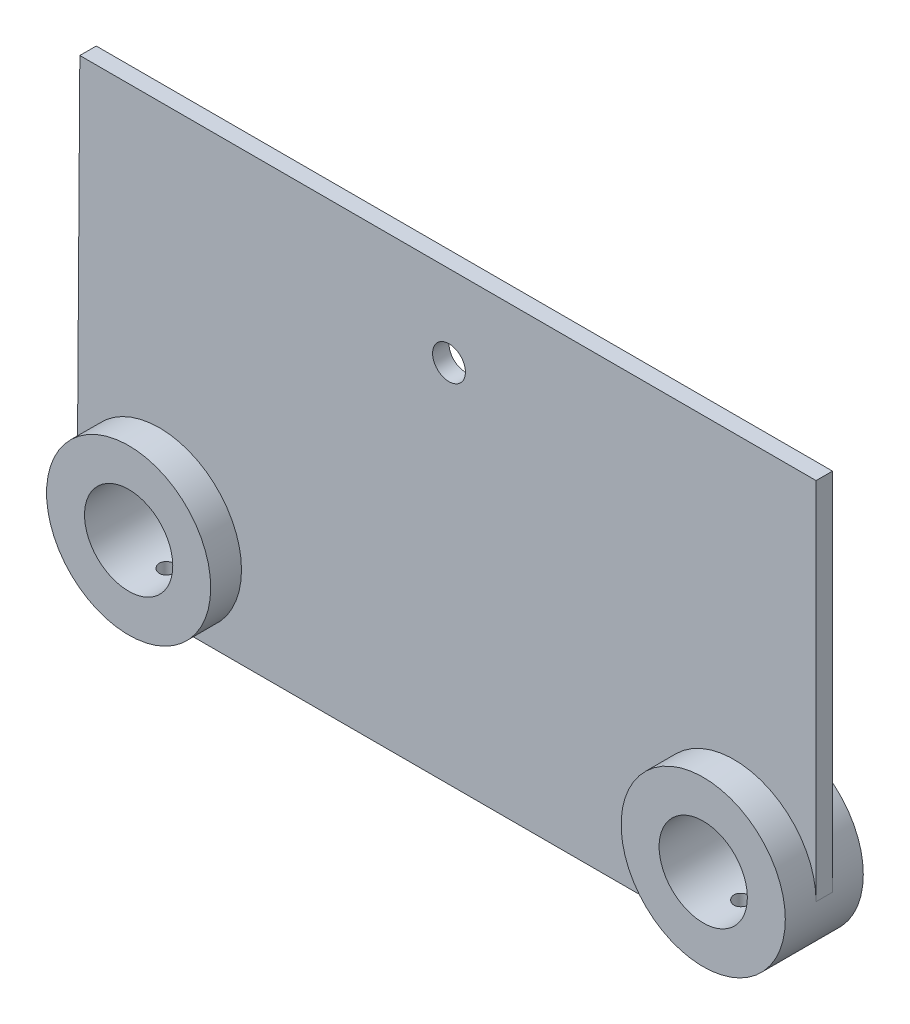
ISO-10303-21;
HEADER;
FILE_DESCRIPTION(('STEP AP214'),'2;1');
FILE_NAME('part.step','',(''),(''),'','','');
FILE_SCHEMA(('AUTOMOTIVE_DESIGN { 1 0 10303 214 1 1 1 1 }'));
ENDSEC;
DATA;
#1=APPLICATION_CONTEXT('core data for automotive mechanical design processes');
#2=APPLICATION_PROTOCOL_DEFINITION('international standard','automotive_design',2000,#1);
#3=PRODUCT_CONTEXT('',#1,'mechanical');
#4=PRODUCT('Part','Part','',(#3));
#5=PRODUCT_RELATED_PRODUCT_CATEGORY('part','',(#4));
#6=PRODUCT_DEFINITION_FORMATION('','',#4);
#7=PRODUCT_DEFINITION_CONTEXT('part definition',#1,'design');
#8=PRODUCT_DEFINITION('design','',#6,#7);
#9=PRODUCT_DEFINITION_SHAPE('','',#8);
#10=(LENGTH_UNIT() NAMED_UNIT(*) SI_UNIT(.MILLI.,.METRE.));
#11=(NAMED_UNIT(*) PLANE_ANGLE_UNIT() SI_UNIT($,.RADIAN.));
#12=(NAMED_UNIT(*) SI_UNIT($,.STERADIAN.) SOLID_ANGLE_UNIT());
#13=UNCERTAINTY_MEASURE_WITH_UNIT(LENGTH_MEASURE(1.E-05),#10,'distance_accuracy_value','');
#14=(GEOMETRIC_REPRESENTATION_CONTEXT(3) GLOBAL_UNCERTAINTY_ASSIGNED_CONTEXT((#13)) GLOBAL_UNIT_ASSIGNED_CONTEXT((#10,
#11,#12)) REPRESENTATION_CONTEXT('',''));
#15=CARTESIAN_POINT('',(0.,0.,0.));
#16=DIRECTION('',(0.,0.,1.));
#17=DIRECTION('',(1.,0.,0.));
#18=AXIS2_PLACEMENT_3D('',#15,#16,#17);
#19=CARTESIAN_POINT('',(70.,0.,2.));
#20=DIRECTION('',(0.,0.,1.));
#21=DIRECTION('',(1.,0.,0.));
#22=AXIS2_PLACEMENT_3D('',#19,#20,#21);
#23=PLANE('',#22);
#24=CARTESIAN_POINT('',(0.554740673181675,69.,2.));
#25=DIRECTION('',(0.,0.,1.));
#26=DIRECTION('',(1.,0.,0.));
#27=AXIS2_PLACEMENT_3D('',#24,#25,#26);
#28=CIRCLE('',#27,4.);
#29=CARTESIAN_POINT('',(4.55474067318168,69.,2.));
#30=VERTEX_POINT('',#29);
#31=EDGE_CURVE('E140',#30,#30,#28,.T.);
#32=ORIENTED_EDGE('',*,*,#31,.F.);
#33=EDGE_LOOP('',(#32));
#34=FACE_BOUND('',#33,.T.);
#35=DIRECTION('',(1.,0.,0.));
#36=VECTOR('',#35,1.);
#37=CARTESIAN_POINT('',(-70.,-20.,2.));
#38=LINE('',#37,#36);
#39=CARTESIAN_POINT('',(-70.,-20.,2.));
#40=VERTEX_POINT('',#39);
#41=CARTESIAN_POINT('',(70.,-20.,2.));
#42=VERTEX_POINT('',#41);
#43=EDGE_CURVE('E114',#40,#42,#38,.T.);
#44=ORIENTED_EDGE('',*,*,#43,.T.);
#45=CARTESIAN_POINT('',(70.,0.,2.));
#46=DIRECTION('',(0.,0.,1.));
#47=DIRECTION('',(1.,0.,0.));
#48=AXIS2_PLACEMENT_3D('',#45,#46,#47);
#49=CIRCLE('',#48,20.);
#50=CARTESIAN_POINT('',(90.,0.,2.));
#51=VERTEX_POINT('',#50);
#52=EDGE_CURVE('E120',#42,#51,#49,.F.);
#53=ORIENTED_EDGE('',*,*,#52,.T.);
#54=DIRECTION('',(0.,1.,0.));
#55=VECTOR('',#54,1.);
#56=CARTESIAN_POINT('',(90.,88.85,2.));
#57=LINE('',#56,#55);
#58=CARTESIAN_POINT('',(90.,88.85,2.));
#59=VERTEX_POINT('',#58);
#60=EDGE_CURVE('E64',#51,#59,#57,.T.);
#61=ORIENTED_EDGE('',*,*,#60,.T.);
#62=DIRECTION('',(-1.,0.,0.));
#63=VECTOR('',#62,1.);
#64=CARTESIAN_POINT('',(-89.3894864788953,88.85,2.));
#65=LINE('',#64,#63);
#66=CARTESIAN_POINT('',(-89.3894864788953,88.85,2.));
#67=VERTEX_POINT('',#66);
#68=EDGE_CURVE('E132',#59,#67,#65,.T.);
#69=ORIENTED_EDGE('',*,*,#68,.T.);
#70=DIRECTION('',(-0.00687112109239564,-0.999976393568835,0.));
#71=VECTOR('',#70,1.);
#72=CARTESIAN_POINT('',(-89.3894864788953,88.85,2.));
#73=LINE('',#72,#71);
#74=CARTESIAN_POINT('',(-89.9981115077974,0.274838355588614,2.));
#75=VERTEX_POINT('',#74);
#76=EDGE_CURVE('E86',#67,#75,#73,.T.);
#77=ORIENTED_EDGE('',*,*,#76,.T.);
#78=CARTESIAN_POINT('',(-70.,0.,2.));
#79=DIRECTION('',(0.,0.,1.));
#80=DIRECTION('',(1.,0.,0.));
#81=AXIS2_PLACEMENT_3D('',#78,#79,#80);
#82=CIRCLE('',#81,20.);
#83=EDGE_CURVE('E128',#75,#40,#82,.F.);
#84=ORIENTED_EDGE('',*,*,#83,.T.);
#85=EDGE_LOOP('',(#44,#53,#61,#69,#77,#84));
#86=FACE_BOUND('',#85,.T.);
#87=ADVANCED_FACE('F33',(#34,#86),#23,.T.);
#88=CARTESIAN_POINT('',(70.,0.,-2.));
#89=DIRECTION('',(0.,0.,1.));
#90=DIRECTION('',(1.,0.,0.));
#91=AXIS2_PLACEMENT_3D('',#88,#89,#90);
#92=PLANE('',#91);
#93=CARTESIAN_POINT('',(0.554740673181675,69.,-2.));
#94=DIRECTION('',(0.,0.,1.));
#95=DIRECTION('',(1.,0.,0.));
#96=AXIS2_PLACEMENT_3D('',#93,#94,#95);
#97=CIRCLE('',#96,4.);
#98=CARTESIAN_POINT('',(4.55474067318168,69.,-2.));
#99=VERTEX_POINT('',#98);
#100=EDGE_CURVE('E202',#99,#99,#97,.F.);
#101=ORIENTED_EDGE('',*,*,#100,.F.);
#102=EDGE_LOOP('',(#101));
#103=FACE_BOUND('',#102,.T.);
#104=CARTESIAN_POINT('',(70.,0.,-2.));
#105=DIRECTION('',(0.,0.,1.));
#106=DIRECTION('',(1.,0.,0.));
#107=AXIS2_PLACEMENT_3D('',#104,#105,#106);
#108=CIRCLE('',#107,20.);
#109=CARTESIAN_POINT('',(70.,-20.,-2.));
#110=VERTEX_POINT('',#109);
#111=CARTESIAN_POINT('',(90.,0.,-2.));
#112=VERTEX_POINT('',#111);
#113=EDGE_CURVE('E124',#110,#112,#108,.F.);
#114=ORIENTED_EDGE('',*,*,#113,.F.);
#115=DIRECTION('',(1.,0.,0.));
#116=VECTOR('',#115,1.);
#117=CARTESIAN_POINT('',(-70.,-20.,-2.));
#118=LINE('',#117,#116);
#119=CARTESIAN_POINT('',(-70.,-20.,-2.));
#120=VERTEX_POINT('',#119);
#121=EDGE_CURVE('E116',#120,#110,#118,.T.);
#122=ORIENTED_EDGE('',*,*,#121,.F.);
#123=CARTESIAN_POINT('',(-70.,0.,-2.));
#124=DIRECTION('',(0.,0.,1.));
#125=DIRECTION('',(1.,0.,0.));
#126=AXIS2_PLACEMENT_3D('',#123,#124,#125);
#127=CIRCLE('',#126,20.);
#128=CARTESIAN_POINT('',(-89.9981115077974,0.274838355589222,-2.));
#129=VERTEX_POINT('',#128);
#130=EDGE_CURVE('E213',#129,#120,#127,.F.);
#131=ORIENTED_EDGE('',*,*,#130,.F.);
#132=DIRECTION('',(-0.00687112109239564,-0.999976393568835,0.));
#133=VECTOR('',#132,1.);
#134=CARTESIAN_POINT('',(-89.3894864788953,88.85,-2.));
#135=LINE('',#134,#133);
#136=CARTESIAN_POINT('',(-89.3894864788953,88.85,-2.));
#137=VERTEX_POINT('',#136);
#138=EDGE_CURVE('E139',#137,#129,#135,.T.);
#139=ORIENTED_EDGE('',*,*,#138,.F.);
#140=DIRECTION('',(-1.,0.,0.));
#141=VECTOR('',#140,1.);
#142=CARTESIAN_POINT('',(-89.3894864788953,88.85,-2.));
#143=LINE('',#142,#141);
#144=CARTESIAN_POINT('',(90.,88.85,-2.));
#145=VERTEX_POINT('',#144);
#146=EDGE_CURVE('E136',#145,#137,#143,.T.);
#147=ORIENTED_EDGE('',*,*,#146,.F.);
#148=DIRECTION('',(0.,1.,0.));
#149=VECTOR('',#148,1.);
#150=CARTESIAN_POINT('',(90.,88.85,-2.));
#151=LINE('',#150,#149);
#152=EDGE_CURVE('E84',#112,#145,#151,.T.);
#153=ORIENTED_EDGE('',*,*,#152,.F.);
#154=EDGE_LOOP('',(#114,#122,#131,#139,#147,#153));
#155=FACE_BOUND('',#154,.T.);
#156=ADVANCED_FACE('F188',(#103,#155),#92,.F.);
#157=CARTESIAN_POINT('',(-89.3894864788953,88.85,2.));
#158=DIRECTION('',(0.999976393568835,-0.00687112109239564,0.));
#159=DIRECTION('',(0.00687112109239564,0.999976393568835,0.));
#160=AXIS2_PLACEMENT_3D('',#157,#158,#159);
#161=PLANE('',#160);
#162=DIRECTION('',(0.,0.,-1.));
#163=VECTOR('',#162,1.);
#164=CARTESIAN_POINT('',(-89.9981115077974,0.274838355588631,9.5));
#165=LINE('',#164,#163);
#166=EDGE_CURVE('E55',#75,#129,#165,.T.);
#167=ORIENTED_EDGE('',*,*,#166,.F.);
#168=ORIENTED_EDGE('',*,*,#76,.F.);
#169=DIRECTION('',(0.,0.,-1.));
#170=VECTOR('',#169,1.);
#171=CARTESIAN_POINT('',(-89.3894864788953,88.85,2.));
#172=LINE('',#171,#170);
#173=EDGE_CURVE('E11',#67,#137,#172,.T.);
#174=ORIENTED_EDGE('',*,*,#173,.T.);
#175=ORIENTED_EDGE('',*,*,#138,.T.);
#176=EDGE_LOOP('',(#167,#168,#174,#175));
#177=FACE_BOUND('',#176,.T.);
#178=ADVANCED_FACE('F186',(#177),#161,.F.);
#179=CARTESIAN_POINT('',(-89.3894864788953,88.85,2.));
#180=DIRECTION('',(0.,-1.,0.));
#181=DIRECTION('',(0.,0.,-1.));
#182=AXIS2_PLACEMENT_3D('',#179,#180,#181);
#183=PLANE('',#182);
#184=ORIENTED_EDGE('',*,*,#146,.T.);
#185=ORIENTED_EDGE('',*,*,#173,.F.);
#186=ORIENTED_EDGE('',*,*,#68,.F.);
#187=DIRECTION('',(0.,0.,-1.));
#188=VECTOR('',#187,1.);
#189=CARTESIAN_POINT('',(90.,88.85,2.));
#190=LINE('',#189,#188);
#191=EDGE_CURVE('E130',#59,#145,#190,.T.);
#192=ORIENTED_EDGE('',*,*,#191,.T.);
#193=EDGE_LOOP('',(#184,#185,#186,#192));
#194=FACE_BOUND('',#193,.T.);
#195=ADVANCED_FACE('F35',(#194),#183,.F.);
#196=CARTESIAN_POINT('',(-70.,0.,2.));
#197=DIRECTION('',(0.,0.,-1.));
#198=DIRECTION('',(-1.,0.,0.));
#199=AXIS2_PLACEMENT_3D('',#196,#197,#198);
#200=CYLINDRICAL_SURFACE('',#199,20.);
#201=ORIENTED_EDGE('',*,*,#130,.T.);
#202=CARTESIAN_POINT('',(-70.,-20.,2.));
#203=CARTESIAN_POINT('',(-69.8879592924169,-19.9999987104154,1.99999514819924));
#204=CARTESIAN_POINT('',(-69.7758445096645,-19.9990485119241,1.99055346220711));
#205=CARTESIAN_POINT('',(-69.5547232030063,-19.9953493518948,1.95303125941914));
#206=CARTESIAN_POINT('',(-69.4457202416624,-19.9925984086805,1.92493020795082));
#207=CARTESIAN_POINT('',(-69.2340566490932,-19.9856082912614,1.85091551880433));
#208=CARTESIAN_POINT('',(-69.1313922307702,-19.9813700160142,1.80501263896305));
#209=CARTESIAN_POINT('',(-68.9352476780792,-19.9718791478861,1.69671818413671));
#210=CARTESIAN_POINT('',(-68.8417657224418,-19.9666267567626,1.63432988799972));
#211=CARTESIAN_POINT('',(-68.6662808986519,-19.9556748868265,1.49459460467545));
#212=CARTESIAN_POINT('',(-68.5843157103302,-19.9499740314773,1.41720040119593));
#213=CARTESIAN_POINT('',(-68.434514957138,-19.9387791381253,1.24975093147394));
#214=CARTESIAN_POINT('',(-68.3666800458347,-19.9332851096983,1.15969507991523));
#215=CARTESIAN_POINT('',(-68.2469320591128,-19.9231118310557,0.969242936632761));
#216=CARTESIAN_POINT('',(-68.1950530690902,-19.9184343342181,0.868825111810284));
#217=CARTESIAN_POINT('',(-68.1089072305145,-19.9104407509305,0.660648828190043));
#218=CARTESIAN_POINT('',(-68.0746399468174,-19.9071246308444,0.552890550832102));
#219=CARTESIAN_POINT('',(-68.0248019167962,-19.9022416814596,0.333476398267984));
#220=CARTESIAN_POINT('',(-68.0091686939924,-19.9006690079619,0.221834846295587));
#221=CARTESIAN_POINT('',(-67.9968494297293,-19.8994328612105,-0.00249772679155691));
#222=CARTESIAN_POINT('',(-68.0001628902584,-19.8997693377749,-0.115188720244114));
#223=CARTESIAN_POINT('',(-68.0255914394946,-19.9023081379787,-0.337990619386631));
#224=CARTESIAN_POINT('',(-68.0476383117509,-19.904503691813,-0.448109398657382));
#225=CARTESIAN_POINT('',(-68.1098017116988,-19.9105026857484,-0.663075926402181));
#226=CARTESIAN_POINT('',(-68.1499184834885,-19.9143061475698,-0.767923603650055));
#227=CARTESIAN_POINT('',(-68.247158212237,-19.9231001890414,-0.969587174597771));
#228=CARTESIAN_POINT('',(-68.30431143456,-19.9280928781632,-1.06638837897862));
#229=CARTESIAN_POINT('',(-68.4339799452935,-19.9387010346576,-1.24905042982376));
#230=CARTESIAN_POINT('',(-68.506495683327,-19.9443165202557,-1.33491095596352));
#231=CARTESIAN_POINT('',(-68.6652117751759,-19.9555677062598,-1.49365078797805));
#232=CARTESIAN_POINT('',(-68.7514710422973,-19.96120338666,-1.5664712037616));
#233=CARTESIAN_POINT('',(-68.9350210365258,-19.9718365815704,-1.69660726582077));
#234=CARTESIAN_POINT('',(-69.0323117760008,-19.9768340953651,-1.75392289471295));
#235=CARTESIAN_POINT('',(-69.2352037886153,-19.9856295133419,-1.8514200406205));
#236=CARTESIAN_POINT('',(-69.3408065072202,-19.9894272082954,-1.89159856963612));
#237=CARTESIAN_POINT('',(-69.5573055653401,-19.9953929488282,-1.9536378334235));
#238=CARTESIAN_POINT('',(-69.6682017464468,-19.9975610431413,-1.97549911598124));
#239=CARTESIAN_POINT('',(-69.8916298018162,-20.0000170333662,-2.00020861546953));
#240=CARTESIAN_POINT('',(-70.004152604211,-20.0003129653547,-2.00313809650499));
#241=CARTESIAN_POINT('',(-70.2280875866314,-19.9990128351359,-1.99011427390247));
#242=CARTESIAN_POINT('',(-70.3394997816409,-19.9974167984894,-1.97416122536944));
#243=CARTESIAN_POINT('',(-70.5578164136693,-19.9925172307839,-1.92389260915685));
#244=CARTESIAN_POINT('',(-70.664729697944,-19.9892172383608,-1.88961509104398));
#245=CARTESIAN_POINT('',(-70.8712886427676,-19.9812799772122,-1.80370965192546));
#246=CARTESIAN_POINT('',(-70.9709341403142,-19.9766426785051,-1.75208134192121));
#247=CARTESIAN_POINT('',(-71.1604963603443,-19.9665295066084,-1.63273832267218));
#248=CARTESIAN_POINT('',(-71.2503793194978,-19.9610508720688,-1.56497022214837));
#249=CARTESIAN_POINT('',(-71.4175232466237,-19.9498786573904,-1.41534786451815));
#250=CARTESIAN_POINT('',(-71.4947838976984,-19.9441850718594,-1.33349325385936));
#251=CARTESIAN_POINT('',(-71.6347722197743,-19.9332004828151,-1.15766685068199));
#252=CARTESIAN_POINT('',(-71.6974465573591,-19.9279110027795,-1.06365248691475));
#253=CARTESIAN_POINT('',(-71.8061165174877,-19.9183566492178,-0.866385279706636));
#254=CARTESIAN_POINT('',(-71.8521123681078,-19.9140917616808,-0.763132562623218));
#255=CARTESIAN_POINT('',(-71.9260304173689,-19.907078952681,-0.550502521068425));
#256=CARTESIAN_POINT('',(-71.9539843496237,-19.9043283689958,-0.44113631981777));
#257=CARTESIAN_POINT('',(-71.9911280142589,-19.9006473056575,-0.219233604078463));
#258=CARTESIAN_POINT('',(-72.000318284799,-19.8997167738037,-0.106697180608657));
#259=CARTESIAN_POINT('',(-71.9996662769425,-19.8997822621512,0.117821376713405));
#260=CARTESIAN_POINT('',(-71.9899077791862,-19.9007698017402,0.229803765765626));
#261=CARTESIAN_POINT('',(-71.9518109059273,-19.9045420777909,0.45052983433657));
#262=CARTESIAN_POINT('',(-71.9234725095243,-19.9073268162744,0.559273510211952));
#263=CARTESIAN_POINT('',(-71.849043372595,-19.9143773652637,0.770434698095707));
#264=CARTESIAN_POINT('',(-71.8029550886818,-19.9186429708072,0.872853083259445));
#265=CARTESIAN_POINT('',(-71.6943431098221,-19.9281750367872,1.06851378334207));
#266=CARTESIAN_POINT('',(-71.6318195069108,-19.933441491619,1.16175614964125));
#267=CARTESIAN_POINT('',(-71.4917971125707,-19.944409744194,1.33684734894386));
#268=CARTESIAN_POINT('',(-71.4142358977806,-19.950113294535,1.41864615273416));
#269=CARTESIAN_POINT('',(-71.2464633984502,-19.9612970945757,1.5681044653993));
#270=CARTESIAN_POINT('',(-71.1562490882165,-19.9667772904595,1.63576058271433));
#271=CARTESIAN_POINT('',(-70.9654828683226,-19.9769112413832,1.75514690770924));
#272=CARTESIAN_POINT('',(-70.8649054986935,-19.9815628805362,1.80683658189036));
#273=CARTESIAN_POINT('',(-70.6565165582011,-19.9894925849979,1.89252484564773));
#274=CARTESIAN_POINT('',(-70.5487132996512,-19.9927721981931,1.92654338190709));
#275=CARTESIAN_POINT('',(-70.3669165228114,-19.9967642754747,1.9674412341696));
#276=CARTESIAN_POINT('',(-70.294085105689,-19.9979720138367,1.97963408859871));
#277=CARTESIAN_POINT('',(-70.1475131616346,-19.9995902990157,1.99591505212352));
#278=CARTESIAN_POINT('',(-70.0737726384531,-20.0000008491205,2.00000319464372));
#279=CARTESIAN_POINT('',(-70.,-20.,2.));
#280=B_SPLINE_CURVE_WITH_KNOTS('',3,(#202,#203,#204,#205,#206,#207,#208,#209,#210,#211,#212,
#213,#214,#215,#216,#217,#218,#219,#220,#221,#222,#223,#224,#225,#226,#227,#228,#229,#230,#231,
#232,#233,#234,#235,#236,#237,#238,#239,#240,#241,#242,#243,#244,#245,#246,#247,#248,#249,#250,
#251,#252,#253,#254,#255,#256,#257,#258,#259,#260,#261,#262,#263,#264,#265,#266,#267,#268,#269,
#270,#271,#272,#273,#274,#275,#276,#277,#278,#279),.UNSPECIFIED.,.T.,.F.,(4,2,2,2,2,2,2,2,2,2,2,
2,2,2,2,2,2,2,2,2,2,2,2,2,2,2,2,2,2,2,2,2,2,2,2,2,2,2,4),(0.,0.335852732536946,
0.672075685670967,1.0080957714644,1.34404907516556,1.68107713724588,2.0181207844141,
2.35587950944443,2.69362988885007,3.03024464090392,3.36685054511552,3.70223594882219,
4.03762588323266,4.37361522745788,4.70961440662249,5.04709468392412,5.38457533959542,
5.72211481387162,6.05964419350877,6.39572377215513,6.73179881038284,7.06717870588607,
7.4025661209893,7.73907881497394,8.07559995620459,8.41333287217195,8.75106116950745,
9.08819381186003,9.42531678479168,9.7609525858791,10.0965887645208,10.432178507256,
10.7677663707792,11.104778348553,11.4418710527391,11.7798126205248,12.1173718959059,
12.3385133446469,12.5596538813805),.UNSPECIFIED.);
#281=EDGE_CURVE('E169',#120,#40,#280,.T.);
#282=ORIENTED_EDGE('',*,*,#281,.T.);
#283=ORIENTED_EDGE('',*,*,#83,.F.);
#284=ORIENTED_EDGE('',*,*,#166,.T.);
#285=EDGE_LOOP('',(#201,#282,#283,#284));
#286=FACE_BOUND('',#285,.T.);
#287=CARTESIAN_POINT('',(-70.,0.,9.5));
#288=DIRECTION('',(0.,0.,1.));
#289=DIRECTION('',(1.,0.,0.));
#290=AXIS2_PLACEMENT_3D('',#287,#288,#289);
#291=CIRCLE('',#290,20.);
#292=CARTESIAN_POINT('',(-50.,0.,9.5));
#293=VERTEX_POINT('',#292);
#294=EDGE_CURVE('E215',#293,#293,#291,.T.);
#295=ORIENTED_EDGE('',*,*,#294,.F.);
#296=EDGE_LOOP('',(#295));
#297=FACE_BOUND('',#296,.T.);
#298=CARTESIAN_POINT('',(-70.,0.,-9.5));
#299=DIRECTION('',(0.,0.,1.));
#300=DIRECTION('',(1.,0.,0.));
#301=AXIS2_PLACEMENT_3D('',#298,#299,#300);
#302=CIRCLE('',#301,20.);
#303=CARTESIAN_POINT('',(-50.,0.,-9.5));
#304=VERTEX_POINT('',#303);
#305=EDGE_CURVE('E220',#304,#304,#302,.T.);
#306=ORIENTED_EDGE('',*,*,#305,.T.);
#307=EDGE_LOOP('',(#306));
#308=FACE_BOUND('',#307,.T.);
#309=ADVANCED_FACE('F182',(#286,#297,#308),#200,.T.);
#310=CARTESIAN_POINT('',(-70.,-20.,2.));
#311=DIRECTION('',(0.,1.,0.));
#312=DIRECTION('',(0.,0.,1.));
#313=AXIS2_PLACEMENT_3D('',#310,#311,#312);
#314=PLANE('',#313);
#315=ORIENTED_EDGE('',*,*,#43,.F.);
#316=CARTESIAN_POINT('',(-70.,-20.,0.));
#317=DIRECTION('',(0.,1.,0.));
#318=DIRECTION('',(0.,0.,1.));
#319=AXIS2_PLACEMENT_3D('',#316,#317,#318);
#320=CIRCLE('',#319,2.);
#321=EDGE_CURVE('E117',#120,#40,#320,.F.);
#322=ORIENTED_EDGE('',*,*,#321,.F.);
#323=ORIENTED_EDGE('',*,*,#121,.T.);
#324=CARTESIAN_POINT('',(70.,-20.,0.));
#325=DIRECTION('',(0.,1.,0.));
#326=DIRECTION('',(0.,0.,1.));
#327=AXIS2_PLACEMENT_3D('',#324,#325,#326);
#328=CIRCLE('',#327,2.);
#329=EDGE_CURVE('E101',#42,#110,#328,.F.);
#330=ORIENTED_EDGE('',*,*,#329,.F.);
#331=EDGE_LOOP('',(#315,#322,#323,#330));
#332=FACE_BOUND('',#331,.T.);
#333=ADVANCED_FACE('F111',(#332),#314,.F.);
#334=CARTESIAN_POINT('',(70.,0.,2.));
#335=DIRECTION('',(0.,0.,-1.));
#336=DIRECTION('',(-1.,0.,0.));
#337=AXIS2_PLACEMENT_3D('',#334,#335,#336);
#338=CYLINDRICAL_SURFACE('',#337,20.);
#339=ORIENTED_EDGE('',*,*,#52,.F.);
#340=CARTESIAN_POINT('',(70.,-20.,2.));
#341=CARTESIAN_POINT('',(70.1120407075831,-19.9999987104154,1.99999514819924));
#342=CARTESIAN_POINT('',(70.2241554903355,-19.9990485119241,1.99055346220711));
#343=CARTESIAN_POINT('',(70.4452767969937,-19.9953493518948,1.95303125941914));
#344=CARTESIAN_POINT('',(70.5542797583377,-19.9925984086805,1.92493020795082));
#345=CARTESIAN_POINT('',(70.7659433509068,-19.9856082912614,1.85091551880433));
#346=CARTESIAN_POINT('',(70.8686077692298,-19.9813700160142,1.80501263896305));
#347=CARTESIAN_POINT('',(71.0647523219208,-19.9718791478861,1.69671818413671));
#348=CARTESIAN_POINT('',(71.1582342775582,-19.9666267567626,1.63432988799972));
#349=CARTESIAN_POINT('',(71.3337191013482,-19.9556748868265,1.49459460467545));
#350=CARTESIAN_POINT('',(71.4156842896698,-19.9499740314773,1.41720040119593));
#351=CARTESIAN_POINT('',(71.565485042862,-19.9387791381253,1.24975093147394));
#352=CARTESIAN_POINT('',(71.6333199541653,-19.9332851096983,1.15969507991523));
#353=CARTESIAN_POINT('',(71.7530679408872,-19.9231118310557,0.969242936632763));
#354=CARTESIAN_POINT('',(71.8049469309098,-19.9184343342181,0.868825111810288));
#355=CARTESIAN_POINT('',(71.8910927694855,-19.9104407509305,0.660648828190047));
#356=CARTESIAN_POINT('',(71.9253600531826,-19.9071246308444,0.552890550832104));
#357=CARTESIAN_POINT('',(71.9751980832038,-19.9022416814596,0.333476398267984));
#358=CARTESIAN_POINT('',(71.9908313060076,-19.9006690079619,0.221834846295587));
#359=CARTESIAN_POINT('',(72.0031505702707,-19.8994328612105,-0.00249772679155687));
#360=CARTESIAN_POINT('',(71.9998371097416,-19.8997693377749,-0.115188720244114));
#361=CARTESIAN_POINT('',(71.9744085605054,-19.9023081379787,-0.337990619386631));
#362=CARTESIAN_POINT('',(71.9523616882491,-19.904503691813,-0.448109398657382));
#363=CARTESIAN_POINT('',(71.8901982883012,-19.9105026857484,-0.663075926402181));
#364=CARTESIAN_POINT('',(71.8500815165115,-19.9143061475698,-0.767923603650055));
#365=CARTESIAN_POINT('',(71.752841787763,-19.9231001890414,-0.969587174597771));
#366=CARTESIAN_POINT('',(71.69568856544,-19.9280928781632,-1.06638837897862));
#367=CARTESIAN_POINT('',(71.5660200547065,-19.9387010346576,-1.24905042982376));
#368=CARTESIAN_POINT('',(71.493504316673,-19.9443165202557,-1.33491095596352));
#369=CARTESIAN_POINT('',(71.3347882248241,-19.9555677062598,-1.49365078797805));
#370=CARTESIAN_POINT('',(71.2485289577027,-19.96120338666,-1.5664712037616));
#371=CARTESIAN_POINT('',(71.0649789634742,-19.9718365815704,-1.69660726582077));
#372=CARTESIAN_POINT('',(70.9676882239992,-19.9768340953651,-1.75392289471295));
#373=CARTESIAN_POINT('',(70.7647962113847,-19.9856295133419,-1.8514200406205));
#374=CARTESIAN_POINT('',(70.6591934927798,-19.9894272082954,-1.89159856963612));
#375=CARTESIAN_POINT('',(70.4426944346599,-19.9953929488282,-1.9536378334235));
#376=CARTESIAN_POINT('',(70.3317982535532,-19.9975610431413,-1.97549911598124));
#377=CARTESIAN_POINT('',(70.1083701981838,-20.0000170333662,-2.00020861546953));
#378=CARTESIAN_POINT('',(69.995847395789,-20.0003129653547,-2.00313809650499));
#379=CARTESIAN_POINT('',(69.7719124133686,-19.9990128351359,-1.99011427390247));
#380=CARTESIAN_POINT('',(69.6605002183591,-19.9974167984894,-1.97416122536944));
#381=CARTESIAN_POINT('',(69.4421835863307,-19.9925172307839,-1.92389260915685));
#382=CARTESIAN_POINT('',(69.335270302056,-19.9892172383608,-1.88961509104398));
#383=CARTESIAN_POINT('',(69.1287113572325,-19.9812799772122,-1.80370965192546));
#384=CARTESIAN_POINT('',(69.0290658596858,-19.9766426785051,-1.75208134192121));
#385=CARTESIAN_POINT('',(68.8395036396557,-19.9665295066084,-1.63273832267218));
#386=CARTESIAN_POINT('',(68.7496206805022,-19.9610508720688,-1.56497022214837));
#387=CARTESIAN_POINT('',(68.5824767533763,-19.9498786573904,-1.41534786451815));
#388=CARTESIAN_POINT('',(68.5052161023017,-19.9441850718594,-1.33349325385936));
#389=CARTESIAN_POINT('',(68.3652277802257,-19.9332004828151,-1.15766685068199));
#390=CARTESIAN_POINT('',(68.3025534426409,-19.9279110027795,-1.06365248691476));
#391=CARTESIAN_POINT('',(68.1938834825124,-19.9183566492178,-0.86638527970664));
#392=CARTESIAN_POINT('',(68.1478876318922,-19.9140917616808,-0.76313256262322));
#393=CARTESIAN_POINT('',(68.0739695826311,-19.907078952681,-0.550502521068425));
#394=CARTESIAN_POINT('',(68.0460156503763,-19.9043283689958,-0.44113631981777));
#395=CARTESIAN_POINT('',(68.0088719857411,-19.9006473056575,-0.219233604078463));
#396=CARTESIAN_POINT('',(67.999681715201,-19.8997167738037,-0.106697180608657));
#397=CARTESIAN_POINT('',(68.0003337230575,-19.8997822621512,0.117821376713405));
#398=CARTESIAN_POINT('',(68.0100922208138,-19.9007698017402,0.229803765765626));
#399=CARTESIAN_POINT('',(68.0481890940727,-19.9045420777909,0.45052983433657));
#400=CARTESIAN_POINT('',(68.0765274904757,-19.9073268162744,0.559273510211952));
#401=CARTESIAN_POINT('',(68.150956627405,-19.9143773652637,0.770434698095707));
#402=CARTESIAN_POINT('',(68.1970449113182,-19.9186429708072,0.872853083259445));
#403=CARTESIAN_POINT('',(68.3056568901779,-19.9281750367872,1.06851378334207));
#404=CARTESIAN_POINT('',(68.3681804930892,-19.933441491619,1.16175614964125));
#405=CARTESIAN_POINT('',(68.5082028874293,-19.944409744194,1.33684734894386));
#406=CARTESIAN_POINT('',(68.5857641022195,-19.950113294535,1.41864615273417));
#407=CARTESIAN_POINT('',(68.7535366015498,-19.9612970945757,1.56810446539931));
#408=CARTESIAN_POINT('',(68.8437509117835,-19.9667772904595,1.63576058271433));
#409=CARTESIAN_POINT('',(69.0345171316774,-19.9769112413832,1.75514690770924));
#410=CARTESIAN_POINT('',(69.1350945013065,-19.9815628805362,1.80683658189036));
#411=CARTESIAN_POINT('',(69.3434834417989,-19.9894925849979,1.89252484564773));
#412=CARTESIAN_POINT('',(69.4512867003488,-19.9927721981931,1.92654338190709));
#413=CARTESIAN_POINT('',(69.6330834771886,-19.9967642754747,1.9674412341696));
#414=CARTESIAN_POINT('',(69.705914894311,-19.9979720138367,1.97963408859871));
#415=CARTESIAN_POINT('',(69.8524868383654,-19.9995902990157,1.99591505212352));
#416=CARTESIAN_POINT('',(69.9262273615469,-20.0000008491205,2.00000319464372));
#417=CARTESIAN_POINT('',(70.,-20.,2.));
#418=B_SPLINE_CURVE_WITH_KNOTS('',3,(#340,#341,#342,#343,#344,#345,#346,#347,#348,#349,#350,
#351,#352,#353,#354,#355,#356,#357,#358,#359,#360,#361,#362,#363,#364,#365,#366,#367,#368,#369,
#370,#371,#372,#373,#374,#375,#376,#377,#378,#379,#380,#381,#382,#383,#384,#385,#386,#387,#388,
#389,#390,#391,#392,#393,#394,#395,#396,#397,#398,#399,#400,#401,#402,#403,#404,#405,#406,#407,
#408,#409,#410,#411,#412,#413,#414,#415,#416,#417),.UNSPECIFIED.,.T.,.F.,(4,2,2,2,2,2,2,2,2,2,2,
2,2,2,2,2,2,2,2,2,2,2,2,2,2,2,2,2,2,2,2,2,2,2,2,2,2,2,4),(0.,0.335852732536946,
0.672075685670967,1.0080957714644,1.34404907516556,1.68107713724588,2.0181207844141,
2.35587950944442,2.69362988885007,3.03024464090392,3.36685054511552,3.70223594882219,
4.03762588323266,4.37361522745788,4.70961440662249,5.04709468392412,5.38457533959542,
5.72211481387162,6.05964419350877,6.39572377215513,6.73179881038284,7.06717870588608,
7.40256612098931,7.73907881497394,8.07559995620459,8.41333287217194,8.75106116950745,
9.08819381186003,9.42531678479168,9.7609525858791,10.0965887645208,10.432178507256,
10.7677663707792,11.104778348553,11.4418710527391,11.7798126205248,12.1173718959059,
12.338513344647,12.5596538813805),.UNSPECIFIED.);
#419=EDGE_CURVE('E98',#42,#110,#418,.T.);
#420=ORIENTED_EDGE('',*,*,#419,.T.);
#421=ORIENTED_EDGE('',*,*,#113,.T.);
#422=DIRECTION('',(0.,0.,-1.));
#423=VECTOR('',#422,1.);
#424=CARTESIAN_POINT('',(90.,0.,2.));
#425=LINE('',#424,#423);
#426=EDGE_CURVE('E47',#51,#112,#425,.T.);
#427=ORIENTED_EDGE('',*,*,#426,.F.);
#428=EDGE_LOOP('',(#339,#420,#421,#427));
#429=FACE_BOUND('',#428,.T.);
#430=CARTESIAN_POINT('',(70.,0.,-9.5));
#431=DIRECTION('',(0.,0.,1.));
#432=DIRECTION('',(1.,0.,0.));
#433=AXIS2_PLACEMENT_3D('',#430,#431,#432);
#434=CIRCLE('',#433,20.);
#435=CARTESIAN_POINT('',(90.,0.,-9.5));
#436=VERTEX_POINT('',#435);
#437=EDGE_CURVE('E232',#436,#436,#434,.T.);
#438=ORIENTED_EDGE('',*,*,#437,.T.);
#439=EDGE_LOOP('',(#438));
#440=FACE_BOUND('',#439,.T.);
#441=CARTESIAN_POINT('',(70.,0.,9.5));
#442=DIRECTION('',(0.,0.,1.));
#443=DIRECTION('',(1.,0.,0.));
#444=AXIS2_PLACEMENT_3D('',#441,#442,#443);
#445=CIRCLE('',#444,20.);
#446=CARTESIAN_POINT('',(90.,0.,9.5));
#447=VERTEX_POINT('',#446);
#448=EDGE_CURVE('E231',#447,#447,#445,.T.);
#449=ORIENTED_EDGE('',*,*,#448,.F.);
#450=EDGE_LOOP('',(#449));
#451=FACE_BOUND('',#450,.T.);
#452=ADVANCED_FACE('F121',(#429,#440,#451),#338,.T.);
#453=CARTESIAN_POINT('',(90.,88.85,2.));
#454=DIRECTION('',(-1.,0.,0.));
#455=DIRECTION('',(0.,0.,1.));
#456=AXIS2_PLACEMENT_3D('',#453,#454,#455);
#457=PLANE('',#456);
#458=ORIENTED_EDGE('',*,*,#152,.T.);
#459=ORIENTED_EDGE('',*,*,#191,.F.);
#460=ORIENTED_EDGE('',*,*,#60,.F.);
#461=ORIENTED_EDGE('',*,*,#426,.T.);
#462=EDGE_LOOP('',(#458,#459,#460,#461));
#463=FACE_BOUND('',#462,.T.);
#464=ADVANCED_FACE('F179',(#463),#457,.F.);
#465=CARTESIAN_POINT('',(0.554740673181675,69.,13.3137084989848));
#466=DIRECTION('',(0.,0.,-1.));
#467=DIRECTION('',(-1.,0.,0.));
#468=AXIS2_PLACEMENT_3D('',#465,#466,#467);
#469=CYLINDRICAL_SURFACE('',#468,4.);
#470=ORIENTED_EDGE('',*,*,#31,.T.);
#471=EDGE_LOOP('',(#470));
#472=FACE_BOUND('',#471,.T.);
#473=ORIENTED_EDGE('',*,*,#100,.T.);
#474=EDGE_LOOP('',(#473));
#475=FACE_BOUND('',#474,.T.);
#476=ADVANCED_FACE('F272',(#472,#475),#469,.F.);
#477=CARTESIAN_POINT('',(-70.,0.,9.5));
#478=DIRECTION('',(0.,0.,1.));
#479=DIRECTION('',(1.,0.,0.));
#480=AXIS2_PLACEMENT_3D('',#477,#478,#479);
#481=PLANE('',#480);
#482=ORIENTED_EDGE('',*,*,#294,.T.);
#483=EDGE_LOOP('',(#482));
#484=FACE_BOUND('',#483,.T.);
#485=CARTESIAN_POINT('',(-70.,0.,9.5));
#486=DIRECTION('',(0.,0.,1.));
#487=DIRECTION('',(1.,0.,0.));
#488=AXIS2_PLACEMENT_3D('',#485,#486,#487);
#489=CIRCLE('',#488,10.75);
#490=CARTESIAN_POINT('',(-59.25,0.,9.5));
#491=VERTEX_POINT('',#490);
#492=EDGE_CURVE('E223',#491,#491,#489,.T.);
#493=ORIENTED_EDGE('',*,*,#492,.F.);
#494=EDGE_LOOP('',(#493));
#495=FACE_BOUND('',#494,.T.);
#496=ADVANCED_FACE('F269',(#484,#495),#481,.T.);
#497=CARTESIAN_POINT('',(-70.,0.,-9.5));
#498=DIRECTION('',(0.,0.,1.));
#499=DIRECTION('',(1.,0.,0.));
#500=AXIS2_PLACEMENT_3D('',#497,#498,#499);
#501=PLANE('',#500);
#502=ORIENTED_EDGE('',*,*,#305,.F.);
#503=EDGE_LOOP('',(#502));
#504=FACE_BOUND('',#503,.T.);
#505=CARTESIAN_POINT('',(-70.,0.,-9.5));
#506=DIRECTION('',(0.,0.,1.));
#507=DIRECTION('',(1.,0.,0.));
#508=AXIS2_PLACEMENT_3D('',#505,#506,#507);
#509=CIRCLE('',#508,10.75);
#510=CARTESIAN_POINT('',(-59.25,0.,-9.5));
#511=VERTEX_POINT('',#510);
#512=EDGE_CURVE('E123',#511,#511,#509,.T.);
#513=ORIENTED_EDGE('',*,*,#512,.T.);
#514=EDGE_LOOP('',(#513));
#515=FACE_BOUND('',#514,.T.);
#516=ADVANCED_FACE('F265',(#504,#515),#501,.F.);
#517=CARTESIAN_POINT('',(-70.,0.,2.));
#518=DIRECTION('',(0.,0.,-1.));
#519=DIRECTION('',(-1.,0.,0.));
#520=AXIS2_PLACEMENT_3D('',#517,#518,#519);
#521=CYLINDRICAL_SURFACE('',#520,10.75);
#522=CARTESIAN_POINT('',(-70.,-10.75,2.));
#523=CARTESIAN_POINT('',(-69.8886884062066,-10.7499979898458,1.99999572987923));
#524=CARTESIAN_POINT('',(-69.7773210720114,-10.7482532629214,1.99067589570434));
#525=CARTESIAN_POINT('',(-69.5577235890218,-10.7414613570524,1.95366618191142));
#526=CARTESIAN_POINT('',(-69.449496186927,-10.7364113726521,1.92596069653518));
#527=CARTESIAN_POINT('',(-69.2393862771223,-10.7235739677097,1.85305648014376));
#528=CARTESIAN_POINT('',(-69.1374981734974,-10.7157890029717,1.80787343897761));
#529=CARTESIAN_POINT('',(-68.9427585720404,-10.6983321752382,1.70134097973054));
#530=CARTESIAN_POINT('',(-68.8499063216768,-10.6886604695776,1.63999290949974));
#531=CARTESIAN_POINT('',(-68.6747689539686,-10.6683704245625,1.5021033437944));
#532=CARTESIAN_POINT('',(-68.5926058730984,-10.6577431617574,1.4254081434464));
#533=CARTESIAN_POINT('',(-68.4422347736922,-10.6368061412874,1.25933206935554));
#534=CARTESIAN_POINT('',(-68.3740277482609,-10.626496406262,1.16995029360962));
#535=CARTESIAN_POINT('',(-68.2529986736233,-10.6072750364208,0.98017760282761));
#536=CARTESIAN_POINT('',(-68.2003005127356,-10.5983749089917,0.879706408962746));
#537=CARTESIAN_POINT('',(-68.112578095646,-10.5831060557579,0.671143630192448));
#538=CARTESIAN_POINT('',(-68.0775523398893,-10.5767371151844,0.563052692731743));
#539=CARTESIAN_POINT('',(-68.026560124455,-10.5673414942507,0.343623644394907));
#540=CARTESIAN_POINT('',(-68.0103809913364,-10.5642775486884,0.232336582972041));
#541=CARTESIAN_POINT('',(-67.9968812142496,-10.5617264498057,0.00858852041986491));
#542=CARTESIAN_POINT('',(-67.9995589055464,-10.5622389807437,-0.103872376204614));
#543=CARTESIAN_POINT('',(-68.0235242596709,-10.5667489902013,-0.32523662996079));
#544=CARTESIAN_POINT('',(-68.0445703036974,-10.5707012207446,-0.434167203135555));
#545=CARTESIAN_POINT('',(-68.104294527668,-10.5815742581251,-0.646923872140133));
#546=CARTESIAN_POINT('',(-68.1429734463614,-10.5884951893386,-0.750749753901178));
#547=CARTESIAN_POINT('',(-68.2371023948096,-10.6045732299577,-0.951057967862437));
#548=CARTESIAN_POINT('',(-68.2926501896413,-10.6137433132819,-1.04749327387876));
#549=CARTESIAN_POINT('',(-68.4188709303336,-10.6332778111083,-1.22976530962569));
#550=CARTESIAN_POINT('',(-68.4895453882909,-10.6436423449628,-1.31560097843804));
#551=CARTESIAN_POINT('',(-68.6453169786072,-10.6645952021616,-1.47563338150307));
#552=CARTESIAN_POINT('',(-68.7306208230186,-10.6751845030451,-1.54962892639735));
#553=CARTESIAN_POINT('',(-68.9125374821522,-10.6952459378521,-1.68228957899809));
#554=CARTESIAN_POINT('',(-69.00915040695,-10.7047180608997,-1.74095453746821));
#555=CARTESIAN_POINT('',(-69.2111510862619,-10.7214965653293,-1.84131754032038));
#556=CARTESIAN_POINT('',(-69.3165493556072,-10.7288003023682,-1.88299489124179));
#557=CARTESIAN_POINT('',(-69.5330168810914,-10.7403986151714,-1.94799742888983));
#558=CARTESIAN_POINT('',(-69.6440855429597,-10.7446935055784,-1.97132453457902));
#559=CARTESIAN_POINT('',(-69.8670098864057,-10.7497470548969,-1.99868491152107));
#560=CARTESIAN_POINT('',(-69.978830622328,-10.7505562406137,-2.00299388167035));
#561=CARTESIAN_POINT('',(-70.2015948915734,-10.7486866910348,-1.99293487570714));
#562=CARTESIAN_POINT('',(-70.3125384670416,-10.746008124353,-1.97856780247996));
#563=CARTESIAN_POINT('',(-70.5295263355471,-10.7374954871991,-1.93179376222618));
#564=CARTESIAN_POINT('',(-70.6356016918895,-10.7316857895141,-1.89952607776594));
#565=CARTESIAN_POINT('',(-70.8408369176349,-10.7175596292842,-1.81801733591484));
#566=CARTESIAN_POINT('',(-70.9399963226445,-10.7092429986024,-1.7687751400335));
#567=CARTESIAN_POINT('',(-71.1297630275124,-10.690899466265,-1.65410342203095));
#568=CARTESIAN_POINT('',(-71.2202666401775,-10.6808550983115,-1.58850516202269));
#569=CARTESIAN_POINT('',(-71.3890802021438,-10.6602158463005,-1.4432120175413));
#570=CARTESIAN_POINT('',(-71.4673890303966,-10.6496209117495,-1.36351583850416));
#571=CARTESIAN_POINT('',(-71.6106358583521,-10.6289073271526,-1.19104182435816));
#572=CARTESIAN_POINT('',(-71.6753858435975,-10.6187967061924,-1.09810671125741));
#573=CARTESIAN_POINT('',(-71.7883557286578,-10.6003572432835,-0.902516771747507));
#574=CARTESIAN_POINT('',(-71.8365762368907,-10.5920283357576,-0.799862303266489));
#575=CARTESIAN_POINT('',(-71.914850726863,-10.5781581458696,-0.588228488755166));
#576=CARTESIAN_POINT('',(-71.9449914233036,-10.5726035790055,-0.479282126098728));
#577=CARTESIAN_POINT('',(-71.9865185590532,-10.5648804078248,-0.257758754255705));
#578=CARTESIAN_POINT('',(-71.997907077872,-10.5627114280671,-0.145182149054252));
#579=CARTESIAN_POINT('',(-72.0015378387343,-10.5620238464973,0.0785232273432223));
#580=CARTESIAN_POINT('',(-71.9940766048592,-10.5634487096283,0.189647120561541));
#581=CARTESIAN_POINT('',(-71.960868262353,-10.5696630140558,0.409027329636835));
#582=CARTESIAN_POINT('',(-71.9351212589772,-10.5744524359854,0.517283661996177));
#583=CARTESIAN_POINT('',(-71.8661965259311,-10.5868325708344,0.727699523221926));
#584=CARTESIAN_POINT('',(-71.8230504258666,-10.5944181984275,0.829869731225177));
#585=CARTESIAN_POINT('',(-71.7205845340372,-10.6115397210939,1.02556856504766));
#586=CARTESIAN_POINT('',(-71.6612636240672,-10.6210757509919,1.11909659281253));
#587=CARTESIAN_POINT('',(-71.5270991087529,-10.6411993787578,1.29634244119845));
#588=CARTESIAN_POINT('',(-71.4520395245613,-10.6518004083814,1.37989528142712));
#589=CARTESIAN_POINT('',(-71.2889791012311,-10.6727585996435,1.53331890454812));
#590=CARTESIAN_POINT('',(-71.2009752927382,-10.6831157046926,1.60318653951032));
#591=CARTESIAN_POINT('',(-71.0135925758674,-10.7025264342028,1.72783285057218));
#592=CARTESIAN_POINT('',(-70.9141199543433,-10.7115677213292,1.78247262327906));
#593=CARTESIAN_POINT('',(-70.7072711245879,-10.7272076880381,1.87417762043734));
#594=CARTESIAN_POINT('',(-70.5999024842144,-10.7338086708492,1.911259425929));
#595=CARTESIAN_POINT('',(-70.4101753845964,-10.7424715014638,1.95922830111321));
#596=CARTESIAN_POINT('',(-70.3289291191636,-10.745278807836,1.97449168030222));
#597=CARTESIAN_POINT('',(-70.165132107554,-10.7490437798718,1.99487898823888));
#598=CARTESIAN_POINT('',(-70.0825813937189,-10.7500014913211,2.0000031679766));
#599=CARTESIAN_POINT('',(-70.,-10.75,2.));
#600=B_SPLINE_CURVE_WITH_KNOTS('',3,(#522,#523,#524,#525,#526,#527,#528,#529,#530,#531,#532,
#533,#534,#535,#536,#537,#538,#539,#540,#541,#542,#543,#544,#545,#546,#547,#548,#549,#550,#551,
#552,#553,#554,#555,#556,#557,#558,#559,#560,#561,#562,#563,#564,#565,#566,#567,#568,#569,#570,
#571,#572,#573,#574,#575,#576,#577,#578,#579,#580,#581,#582,#583,#584,#585,#586,#587,#588,#589,
#590,#591,#592,#593,#594,#595,#596,#597,#598,#599),.UNSPECIFIED.,.T.,.F.,(4,2,2,2,2,2,2,2,2,2,2,
2,2,2,2,2,2,2,2,2,2,2,2,2,2,2,2,2,2,2,2,2,2,2,2,2,2,2,4),(0.,0.333632786805715,
0.667549124274137,1.00116639340959,1.33475585412829,1.67187050268571,2.00900913178153,
2.3487720265472,2.68850608659446,3.02436811950801,3.3602005019206,3.69168078753445,
4.02317496216752,4.35662824282036,4.69011487182468,5.02877436453896,5.36743715382765,
5.70651126118905,6.04554990542492,6.37965713991974,6.71374822274426,7.04527552096233,
7.37682505923944,7.71194784376341,8.04710141746386,8.38663285340672,8.7261517905143,
9.06402902298355,9.40186878426489,9.73442721190289,10.0669837253029,10.3989383941257,
10.730916017629,11.0677885056382,11.4047383917491,11.7446680944371,12.0842761377134,
12.3318023983814,12.5793225316018),.UNSPECIFIED.);
#601=CARTESIAN_POINT('',(-70.,-10.75,2.));
#602=VERTEX_POINT('',#601);
#603=EDGE_CURVE('E37',#602,#602,#600,.T.);
#604=ORIENTED_EDGE('',*,*,#603,.F.);
#605=EDGE_LOOP('',(#604));
#606=FACE_BOUND('',#605,.T.);
#607=ORIENTED_EDGE('',*,*,#512,.F.);
#608=EDGE_LOOP('',(#607));
#609=FACE_BOUND('',#608,.T.);
#610=ORIENTED_EDGE('',*,*,#492,.T.);
#611=EDGE_LOOP('',(#610));
#612=FACE_BOUND('',#611,.T.);
#613=ADVANCED_FACE('F256',(#606,#609,#612),#521,.F.);
#614=CARTESIAN_POINT('',(70.,0.,-9.5));
#615=DIRECTION('',(0.,0.,1.));
#616=DIRECTION('',(1.,0.,0.));
#617=AXIS2_PLACEMENT_3D('',#614,#615,#616);
#618=PLANE('',#617);
#619=ORIENTED_EDGE('',*,*,#437,.F.);
#620=EDGE_LOOP('',(#619));
#621=FACE_BOUND('',#620,.T.);
#622=CARTESIAN_POINT('',(70.,0.,-9.5));
#623=DIRECTION('',(0.,0.,1.));
#624=DIRECTION('',(1.,0.,0.));
#625=AXIS2_PLACEMENT_3D('',#622,#623,#624);
#626=CIRCLE('',#625,10.75);
#627=CARTESIAN_POINT('',(80.75,0.,-9.5));
#628=VERTEX_POINT('',#627);
#629=EDGE_CURVE('E238',#628,#628,#626,.T.);
#630=ORIENTED_EDGE('',*,*,#629,.T.);
#631=EDGE_LOOP('',(#630));
#632=FACE_BOUND('',#631,.T.);
#633=ADVANCED_FACE('F249',(#621,#632),#618,.F.);
#634=CARTESIAN_POINT('',(70.,0.,2.));
#635=DIRECTION('',(0.,0.,-1.));
#636=DIRECTION('',(-1.,0.,0.));
#637=AXIS2_PLACEMENT_3D('',#634,#635,#636);
#638=CYLINDRICAL_SURFACE('',#637,10.75);
#639=CARTESIAN_POINT('',(70.,-10.75,2.));
#640=CARTESIAN_POINT('',(70.1113115937934,-10.7499979898458,1.99999572987923));
#641=CARTESIAN_POINT('',(70.2226789279886,-10.7482532629214,1.99067589570434));
#642=CARTESIAN_POINT('',(70.4422764109782,-10.7414613570524,1.95366618191142));
#643=CARTESIAN_POINT('',(70.5505038130731,-10.7364113726521,1.92596069653518));
#644=CARTESIAN_POINT('',(70.7606137228777,-10.7235739677097,1.85305648014376));
#645=CARTESIAN_POINT('',(70.8625018265026,-10.7157890029717,1.80787343897761));
#646=CARTESIAN_POINT('',(71.0572414279596,-10.6983321752382,1.70134097973054));
#647=CARTESIAN_POINT('',(71.1500936783232,-10.6886604695776,1.63999290949974));
#648=CARTESIAN_POINT('',(71.3252310460314,-10.6683704245625,1.5021033437944));
#649=CARTESIAN_POINT('',(71.4073941269017,-10.6577431617574,1.4254081434464));
#650=CARTESIAN_POINT('',(71.5577652263078,-10.6368061412874,1.25933206935554));
#651=CARTESIAN_POINT('',(71.6259722517391,-10.626496406262,1.16995029360962));
#652=CARTESIAN_POINT('',(71.7470013263767,-10.6072750364208,0.98017760282761));
#653=CARTESIAN_POINT('',(71.7996994872645,-10.5983749089917,0.879706408962746));
#654=CARTESIAN_POINT('',(71.887421904354,-10.5831060557579,0.671143630192448));
#655=CARTESIAN_POINT('',(71.9224476601107,-10.5767371151844,0.563052692731743));
#656=CARTESIAN_POINT('',(71.973439875545,-10.5673414942507,0.343623644394907));
#657=CARTESIAN_POINT('',(71.9896190086636,-10.5642775486884,0.232336582972041));
#658=CARTESIAN_POINT('',(72.0031187857504,-10.5617264498057,0.00858852041986491));
#659=CARTESIAN_POINT('',(72.0004410944537,-10.5622389807437,-0.103872376204614));
#660=CARTESIAN_POINT('',(71.9764757403291,-10.5667489902013,-0.32523662996079));
#661=CARTESIAN_POINT('',(71.9554296963026,-10.5707012207446,-0.434167203135555));
#662=CARTESIAN_POINT('',(71.895705472332,-10.5815742581251,-0.646923872140133));
#663=CARTESIAN_POINT('',(71.8570265536386,-10.5884951893386,-0.750749753901178));
#664=CARTESIAN_POINT('',(71.7628976051904,-10.6045732299577,-0.951057967862437));
#665=CARTESIAN_POINT('',(71.7073498103587,-10.6137433132819,-1.04749327387876));
#666=CARTESIAN_POINT('',(71.5811290696664,-10.6332778111083,-1.22976530962569));
#667=CARTESIAN_POINT('',(71.5104546117091,-10.6436423449628,-1.31560097843804));
#668=CARTESIAN_POINT('',(71.3546830213928,-10.6645952021616,-1.47563338150307));
#669=CARTESIAN_POINT('',(71.2693791769815,-10.6751845030451,-1.54962892639735));
#670=CARTESIAN_POINT('',(71.0874625178478,-10.6952459378521,-1.68228957899809));
#671=CARTESIAN_POINT('',(70.99084959305,-10.7047180608997,-1.74095453746821));
#672=CARTESIAN_POINT('',(70.7888489137381,-10.7214965653293,-1.84131754032038));
#673=CARTESIAN_POINT('',(70.6834506443929,-10.7288003023682,-1.88299489124179));
#674=CARTESIAN_POINT('',(70.4669831189086,-10.7403986151714,-1.94799742888983));
#675=CARTESIAN_POINT('',(70.3559144570404,-10.7446935055784,-1.97132453457902));
#676=CARTESIAN_POINT('',(70.1329901135943,-10.7497470548969,-1.99868491152107));
#677=CARTESIAN_POINT('',(70.021169377672,-10.7505562406137,-2.00299388167035));
#678=CARTESIAN_POINT('',(69.7984051084266,-10.7486866910348,-1.99293487570714));
#679=CARTESIAN_POINT('',(69.6874615329584,-10.746008124353,-1.97856780247996));
#680=CARTESIAN_POINT('',(69.4704736644529,-10.7374954871991,-1.93179376222618));
#681=CARTESIAN_POINT('',(69.3643983081105,-10.7316857895141,-1.89952607776594));
#682=CARTESIAN_POINT('',(69.1591630823651,-10.7175596292842,-1.81801733591484));
#683=CARTESIAN_POINT('',(69.0600036773555,-10.7092429986024,-1.7687751400335));
#684=CARTESIAN_POINT('',(68.8702369724876,-10.690899466265,-1.65410342203095));
#685=CARTESIAN_POINT('',(68.7797333598225,-10.6808550983115,-1.58850516202269));
#686=CARTESIAN_POINT('',(68.6109197978562,-10.6602158463005,-1.4432120175413));
#687=CARTESIAN_POINT('',(68.5326109696034,-10.6496209117495,-1.36351583850416));
#688=CARTESIAN_POINT('',(68.3893641416479,-10.6289073271526,-1.19104182435815));
#689=CARTESIAN_POINT('',(68.3246141564025,-10.6187967061924,-1.09810671125741));
#690=CARTESIAN_POINT('',(68.2116442713422,-10.6003572432835,-0.902516771747504));
#691=CARTESIAN_POINT('',(68.1634237631093,-10.5920283357576,-0.799862303266487));
#692=CARTESIAN_POINT('',(68.0851492731371,-10.5781581458696,-0.588228488755167));
#693=CARTESIAN_POINT('',(68.0550085766964,-10.5726035790055,-0.479282126098731));
#694=CARTESIAN_POINT('',(68.0134814409468,-10.5648804078248,-0.257758754255709));
#695=CARTESIAN_POINT('',(68.002092922128,-10.5627114280671,-0.145182149054254));
#696=CARTESIAN_POINT('',(67.9984621612657,-10.5620238464973,0.0785232273432225));
#697=CARTESIAN_POINT('',(68.0059233951408,-10.5634487096283,0.189647120561541));
#698=CARTESIAN_POINT('',(68.0391317376471,-10.5696630140558,0.409027329636835));
#699=CARTESIAN_POINT('',(68.0648787410228,-10.5744524359854,0.517283661996177));
#700=CARTESIAN_POINT('',(68.1338034740689,-10.5868325708344,0.727699523221925));
#701=CARTESIAN_POINT('',(68.1769495741334,-10.5944181984275,0.829869731225173));
#702=CARTESIAN_POINT('',(68.2794154659628,-10.6115397210939,1.02556856504765));
#703=CARTESIAN_POINT('',(68.3387363759328,-10.6210757509919,1.11909659281253));
#704=CARTESIAN_POINT('',(68.4729008912471,-10.6411993787578,1.29634244119845));
#705=CARTESIAN_POINT('',(68.5479604754388,-10.6518004083814,1.37989528142712));
#706=CARTESIAN_POINT('',(68.7110208987689,-10.6727585996435,1.53331890454812));
#707=CARTESIAN_POINT('',(68.7990247072618,-10.6831157046926,1.60318653951032));
#708=CARTESIAN_POINT('',(68.9864074241326,-10.7025264342028,1.72783285057218));
#709=CARTESIAN_POINT('',(69.0858800456567,-10.7115677213292,1.78247262327906));
#710=CARTESIAN_POINT('',(69.2927288754121,-10.7272076880381,1.87417762043734));
#711=CARTESIAN_POINT('',(69.4000975157856,-10.7338086708492,1.911259425929));
#712=CARTESIAN_POINT('',(69.5898246154037,-10.7424715014638,1.95922830111321));
#713=CARTESIAN_POINT('',(69.6710708808364,-10.745278807836,1.97449168030222));
#714=CARTESIAN_POINT('',(69.8348678924461,-10.7490437798718,1.99487898823888));
#715=CARTESIAN_POINT('',(69.9174186062812,-10.7500014913211,2.0000031679766));
#716=CARTESIAN_POINT('',(70.,-10.75,2.));
#717=B_SPLINE_CURVE_WITH_KNOTS('',3,(#639,#640,#641,#642,#643,#644,#645,#646,#647,#648,#649,
#650,#651,#652,#653,#654,#655,#656,#657,#658,#659,#660,#661,#662,#663,#664,#665,#666,#667,#668,
#669,#670,#671,#672,#673,#674,#675,#676,#677,#678,#679,#680,#681,#682,#683,#684,#685,#686,#687,
#688,#689,#690,#691,#692,#693,#694,#695,#696,#697,#698,#699,#700,#701,#702,#703,#704,#705,#706,
#707,#708,#709,#710,#711,#712,#713,#714,#715,#716),.UNSPECIFIED.,.T.,.F.,(4,2,2,2,2,2,2,2,2,2,2,
2,2,2,2,2,2,2,2,2,2,2,2,2,2,2,2,2,2,2,2,2,2,2,2,2,2,2,4),(0.,0.333632786805715,
0.667549124274137,1.00116639340959,1.33475585412829,1.67187050268571,2.00900913178153,
2.3487720265472,2.68850608659446,3.02436811950801,3.3602005019206,3.69168078753445,
4.02317496216752,4.35662824282036,4.69011487182468,5.02877436453896,5.36743715382765,
5.70651126118905,6.04554990542492,6.37965713991974,6.71374822274426,7.04527552096233,
7.37682505923944,7.71194784376341,8.04710141746386,8.38663285340673,8.7261517905143,
9.06402902298354,9.40186878426489,9.73442721190289,10.0669837253029,10.3989383941257,
10.730916017629,11.0677885056382,11.4047383917491,11.7446680944371,12.0842761377134,
12.3318023983814,12.5793225316018),.UNSPECIFIED.);
#718=CARTESIAN_POINT('',(70.,-10.75,2.));
#719=VERTEX_POINT('',#718);
#720=EDGE_CURVE('E106',#719,#719,#717,.T.);
#721=ORIENTED_EDGE('',*,*,#720,.F.);
#722=EDGE_LOOP('',(#721));
#723=FACE_BOUND('',#722,.T.);
#724=ORIENTED_EDGE('',*,*,#629,.F.);
#725=EDGE_LOOP('',(#724));
#726=FACE_BOUND('',#725,.T.);
#727=CARTESIAN_POINT('',(70.,0.,9.5));
#728=DIRECTION('',(0.,0.,1.));
#729=DIRECTION('',(1.,0.,0.));
#730=AXIS2_PLACEMENT_3D('',#727,#728,#729);
#731=CIRCLE('',#730,10.75);
#732=CARTESIAN_POINT('',(80.75,0.,9.5));
#733=VERTEX_POINT('',#732);
#734=EDGE_CURVE('E235',#733,#733,#731,.T.);
#735=ORIENTED_EDGE('',*,*,#734,.T.);
#736=EDGE_LOOP('',(#735));
#737=FACE_BOUND('',#736,.T.);
#738=ADVANCED_FACE('F151',(#723,#726,#737),#638,.F.);
#739=CARTESIAN_POINT('',(70.,0.,9.5));
#740=DIRECTION('',(0.,0.,1.));
#741=DIRECTION('',(1.,0.,0.));
#742=AXIS2_PLACEMENT_3D('',#739,#740,#741);
#743=PLANE('',#742);
#744=ORIENTED_EDGE('',*,*,#448,.T.);
#745=EDGE_LOOP('',(#744));
#746=FACE_BOUND('',#745,.T.);
#747=ORIENTED_EDGE('',*,*,#734,.F.);
#748=EDGE_LOOP('',(#747));
#749=FACE_BOUND('',#748,.T.);
#750=ADVANCED_FACE('F158',(#746,#749),#743,.T.);
#751=CARTESIAN_POINT('',(70.,-25.6568542494924,0.));
#752=DIRECTION('',(0.,1.,0.));
#753=DIRECTION('',(0.,0.,1.));
#754=AXIS2_PLACEMENT_3D('',#751,#752,#753);
#755=CYLINDRICAL_SURFACE('',#754,2.);
#756=ORIENTED_EDGE('',*,*,#720,.T.);
#757=EDGE_LOOP('',(#756));
#758=FACE_BOUND('',#757,.T.);
#759=ORIENTED_EDGE('',*,*,#329,.T.);
#760=ORIENTED_EDGE('',*,*,#419,.F.);
#761=EDGE_LOOP('',(#759,#760));
#762=FACE_BOUND('',#761,.T.);
#763=ADVANCED_FACE('F100',(#758,#762),#755,.F.);
#764=CARTESIAN_POINT('',(-70.,-25.6568542494924,0.));
#765=DIRECTION('',(0.,1.,0.));
#766=DIRECTION('',(0.,0.,1.));
#767=AXIS2_PLACEMENT_3D('',#764,#765,#766);
#768=CYLINDRICAL_SURFACE('',#767,2.);
#769=ORIENTED_EDGE('',*,*,#603,.T.);
#770=EDGE_LOOP('',(#769));
#771=FACE_BOUND('',#770,.T.);
#772=ORIENTED_EDGE('',*,*,#321,.T.);
#773=ORIENTED_EDGE('',*,*,#281,.F.);
#774=EDGE_LOOP('',(#772,#773));
#775=FACE_BOUND('',#774,.T.);
#776=ADVANCED_FACE('F157',(#771,#775),#768,.F.);
#777=CLOSED_SHELL('',(#87,#156,#178,#195,#309,#333,#452,#464,#476,#496,#516,#613,#633,#738,#750,
#763,#776));
#778=MANIFOLD_SOLID_BREP('B2',#777);
#779=ADVANCED_BREP_SHAPE_REPRESENTATION('',(#18,#778),#14);
#780=SHAPE_DEFINITION_REPRESENTATION(#9,#779);
ENDSEC;
END-ISO-10303-21;
